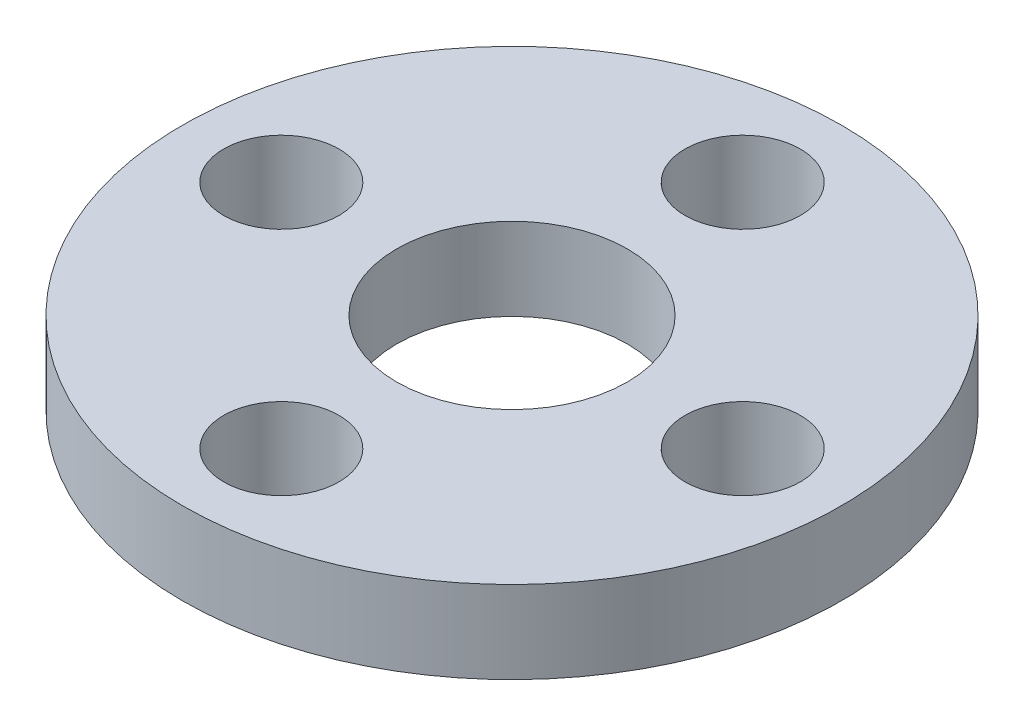
ISO-10303-21;
HEADER;
FILE_DESCRIPTION(('STEP AP214'),'2;1');
FILE_NAME('part.step','',(''),(''),'','','');
FILE_SCHEMA(('AUTOMOTIVE_DESIGN { 1 0 10303 214 1 1 1 1 }'));
ENDSEC;
DATA;
#1=APPLICATION_CONTEXT('core data for automotive mechanical design processes');
#2=APPLICATION_PROTOCOL_DEFINITION('international standard','automotive_design',2000,#1);
#3=PRODUCT_CONTEXT('',#1,'mechanical');
#4=PRODUCT('Part','Part','',(#3));
#5=PRODUCT_RELATED_PRODUCT_CATEGORY('part','',(#4));
#6=PRODUCT_DEFINITION_FORMATION('','',#4);
#7=PRODUCT_DEFINITION_CONTEXT('part definition',#1,'design');
#8=PRODUCT_DEFINITION('design','',#6,#7);
#9=PRODUCT_DEFINITION_SHAPE('','',#8);
#10=(LENGTH_UNIT() NAMED_UNIT(*) SI_UNIT(.MILLI.,.METRE.));
#11=(NAMED_UNIT(*) PLANE_ANGLE_UNIT() SI_UNIT($,.RADIAN.));
#12=(NAMED_UNIT(*) SI_UNIT($,.STERADIAN.) SOLID_ANGLE_UNIT());
#13=UNCERTAINTY_MEASURE_WITH_UNIT(LENGTH_MEASURE(1.E-05),#10,'distance_accuracy_value','');
#14=(GEOMETRIC_REPRESENTATION_CONTEXT(3) GLOBAL_UNCERTAINTY_ASSIGNED_CONTEXT((#13)) GLOBAL_UNIT_ASSIGNED_CONTEXT((#10,
#11,#12)) REPRESENTATION_CONTEXT('',''));
#15=CARTESIAN_POINT('',(0.,0.,0.));
#16=DIRECTION('',(0.,0.,1.));
#17=DIRECTION('',(1.,0.,0.));
#18=AXIS2_PLACEMENT_3D('',#15,#16,#17);
#19=CARTESIAN_POINT('',(0.,2.5,0.));
#20=DIRECTION('',(0.,1.,0.));
#21=DIRECTION('',(0.,0.,1.));
#22=AXIS2_PLACEMENT_3D('',#19,#20,#21);
#23=PLANE('',#22);
#24=CARTESIAN_POINT('',(0.,2.5,0.));
#25=DIRECTION('',(0.,1.,0.));
#26=DIRECTION('',(0.,0.,1.));
#27=AXIS2_PLACEMENT_3D('',#24,#25,#26);
#28=CIRCLE('',#27,3.5);
#29=CARTESIAN_POINT('',(0.,2.5,3.5));
#30=VERTEX_POINT('',#29);
#31=EDGE_CURVE('E75',#30,#30,#28,.T.);
#32=ORIENTED_EDGE('',*,*,#31,.F.);
#33=EDGE_LOOP('',(#32));
#34=FACE_BOUND('',#33,.T.);
#35=CARTESIAN_POINT('',(7.,2.5,0.));
#36=DIRECTION('',(0.,1.,0.));
#37=DIRECTION('',(0.,0.,1.));
#38=AXIS2_PLACEMENT_3D('',#35,#36,#37);
#39=CIRCLE('',#38,1.75);
#40=CARTESIAN_POINT('',(7.,2.5,1.75));
#41=VERTEX_POINT('',#40);
#42=EDGE_CURVE('E60',#41,#41,#39,.T.);
#43=ORIENTED_EDGE('',*,*,#42,.F.);
#44=EDGE_LOOP('',(#43));
#45=FACE_BOUND('',#44,.T.);
#46=CARTESIAN_POINT('',(-7.,2.5,0.));
#47=DIRECTION('',(0.,1.,0.));
#48=DIRECTION('',(0.,0.,1.));
#49=AXIS2_PLACEMENT_3D('',#46,#47,#48);
#50=CIRCLE('',#49,1.75);
#51=CARTESIAN_POINT('',(-7.,2.5,1.75));
#52=VERTEX_POINT('',#51);
#53=EDGE_CURVE('E49',#52,#52,#50,.T.);
#54=ORIENTED_EDGE('',*,*,#53,.F.);
#55=EDGE_LOOP('',(#54));
#56=FACE_BOUND('',#55,.T.);
#57=CARTESIAN_POINT('',(0.,2.5,0.));
#58=DIRECTION('',(0.,1.,0.));
#59=DIRECTION('',(0.,0.,1.));
#60=AXIS2_PLACEMENT_3D('',#57,#58,#59);
#61=CIRCLE('',#60,10.);
#62=CARTESIAN_POINT('',(0.,2.5,10.));
#63=VERTEX_POINT('',#62);
#64=EDGE_CURVE('E10',#63,#63,#61,.T.);
#65=ORIENTED_EDGE('',*,*,#64,.T.);
#66=EDGE_LOOP('',(#65));
#67=FACE_BOUND('',#66,.T.);
#68=CARTESIAN_POINT('',(0.,2.5,-7.));
#69=DIRECTION('',(0.,1.,0.));
#70=DIRECTION('',(0.,0.,1.));
#71=AXIS2_PLACEMENT_3D('',#68,#69,#70);
#72=CIRCLE('',#71,1.75);
#73=CARTESIAN_POINT('',(0.,2.5,-5.25));
#74=VERTEX_POINT('',#73);
#75=EDGE_CURVE('E54',#74,#74,#72,.T.);
#76=ORIENTED_EDGE('',*,*,#75,.F.);
#77=EDGE_LOOP('',(#76));
#78=FACE_BOUND('',#77,.T.);
#79=CARTESIAN_POINT('',(0.,2.5,7.));
#80=DIRECTION('',(0.,1.,0.));
#81=DIRECTION('',(0.,0.,1.));
#82=AXIS2_PLACEMENT_3D('',#79,#80,#81);
#83=CIRCLE('',#82,1.75);
#84=CARTESIAN_POINT('',(0.,2.5,8.75));
#85=VERTEX_POINT('',#84);
#86=EDGE_CURVE('E66',#85,#85,#83,.T.);
#87=ORIENTED_EDGE('',*,*,#86,.F.);
#88=EDGE_LOOP('',(#87));
#89=FACE_BOUND('',#88,.T.);
#90=ADVANCED_FACE('F38',(#34,#45,#56,#67,#78,#89),#23,.T.);
#91=CARTESIAN_POINT('',(0.,0.,0.));
#92=DIRECTION('',(0.,1.,0.));
#93=DIRECTION('',(0.,0.,1.));
#94=AXIS2_PLACEMENT_3D('',#91,#92,#93);
#95=PLANE('',#94);
#96=CARTESIAN_POINT('',(0.,0.,0.));
#97=DIRECTION('',(0.,1.,0.));
#98=DIRECTION('',(0.,0.,1.));
#99=AXIS2_PLACEMENT_3D('',#96,#97,#98);
#100=CIRCLE('',#99,3.5);
#101=CARTESIAN_POINT('',(0.,0.,3.5));
#102=VERTEX_POINT('',#101);
#103=EDGE_CURVE('E72',#102,#102,#100,.T.);
#104=ORIENTED_EDGE('',*,*,#103,.T.);
#105=EDGE_LOOP('',(#104));
#106=FACE_BOUND('',#105,.T.);
#107=CARTESIAN_POINT('',(0.,0.,0.));
#108=DIRECTION('',(0.,1.,0.));
#109=DIRECTION('',(0.,0.,1.));
#110=AXIS2_PLACEMENT_3D('',#107,#108,#109);
#111=CIRCLE('',#110,10.);
#112=CARTESIAN_POINT('',(0.,0.,10.));
#113=VERTEX_POINT('',#112);
#114=EDGE_CURVE('E42',#113,#113,#111,.T.);
#115=ORIENTED_EDGE('',*,*,#114,.F.);
#116=EDGE_LOOP('',(#115));
#117=FACE_BOUND('',#116,.T.);
#118=CARTESIAN_POINT('',(-7.,0.,0.));
#119=DIRECTION('',(0.,1.,0.));
#120=DIRECTION('',(0.,0.,1.));
#121=AXIS2_PLACEMENT_3D('',#118,#119,#120);
#122=CIRCLE('',#121,1.75);
#123=CARTESIAN_POINT('',(-7.,0.,1.75));
#124=VERTEX_POINT('',#123);
#125=EDGE_CURVE('E51',#124,#124,#122,.T.);
#126=ORIENTED_EDGE('',*,*,#125,.T.);
#127=EDGE_LOOP('',(#126));
#128=FACE_BOUND('',#127,.T.);
#129=CARTESIAN_POINT('',(0.,0.,-7.));
#130=DIRECTION('',(0.,1.,0.));
#131=DIRECTION('',(0.,0.,1.));
#132=AXIS2_PLACEMENT_3D('',#129,#130,#131);
#133=CIRCLE('',#132,1.75);
#134=CARTESIAN_POINT('',(0.,0.,-5.25));
#135=VERTEX_POINT('',#134);
#136=EDGE_CURVE('E57',#135,#135,#133,.T.);
#137=ORIENTED_EDGE('',*,*,#136,.T.);
#138=EDGE_LOOP('',(#137));
#139=FACE_BOUND('',#138,.T.);
#140=CARTESIAN_POINT('',(7.,0.,0.));
#141=DIRECTION('',(0.,1.,0.));
#142=DIRECTION('',(0.,0.,1.));
#143=AXIS2_PLACEMENT_3D('',#140,#141,#142);
#144=CIRCLE('',#143,1.75);
#145=CARTESIAN_POINT('',(7.,0.,1.75));
#146=VERTEX_POINT('',#145);
#147=EDGE_CURVE('E63',#146,#146,#144,.T.);
#148=ORIENTED_EDGE('',*,*,#147,.T.);
#149=EDGE_LOOP('',(#148));
#150=FACE_BOUND('',#149,.T.);
#151=CARTESIAN_POINT('',(0.,0.,7.));
#152=DIRECTION('',(0.,1.,0.));
#153=DIRECTION('',(0.,0.,1.));
#154=AXIS2_PLACEMENT_3D('',#151,#152,#153);
#155=CIRCLE('',#154,1.75);
#156=CARTESIAN_POINT('',(0.,0.,8.75));
#157=VERTEX_POINT('',#156);
#158=EDGE_CURVE('E69',#157,#157,#155,.T.);
#159=ORIENTED_EDGE('',*,*,#158,.T.);
#160=EDGE_LOOP('',(#159));
#161=FACE_BOUND('',#160,.T.);
#162=ADVANCED_FACE('F81',(#106,#117,#128,#139,#150,#161),#95,.F.);
#163=CARTESIAN_POINT('',(0.,2.5,0.));
#164=DIRECTION('',(0.,-1.,0.));
#165=DIRECTION('',(0.,0.,-1.));
#166=AXIS2_PLACEMENT_3D('',#163,#164,#165);
#167=CYLINDRICAL_SURFACE('',#166,10.);
#168=ORIENTED_EDGE('',*,*,#64,.F.);
#169=EDGE_LOOP('',(#168));
#170=FACE_BOUND('',#169,.T.);
#171=ORIENTED_EDGE('',*,*,#114,.T.);
#172=EDGE_LOOP('',(#171));
#173=FACE_BOUND('',#172,.T.);
#174=ADVANCED_FACE('F40',(#170,#173),#167,.T.);
#175=CARTESIAN_POINT('',(-7.,2.5,0.));
#176=DIRECTION('',(0.,-1.,0.));
#177=DIRECTION('',(0.,0.,-1.));
#178=AXIS2_PLACEMENT_3D('',#175,#176,#177);
#179=CYLINDRICAL_SURFACE('',#178,1.75);
#180=ORIENTED_EDGE('',*,*,#53,.T.);
#181=EDGE_LOOP('',(#180));
#182=FACE_BOUND('',#181,.T.);
#183=ORIENTED_EDGE('',*,*,#125,.F.);
#184=EDGE_LOOP('',(#183));
#185=FACE_BOUND('',#184,.T.);
#186=ADVANCED_FACE('F112',(#182,#185),#179,.F.);
#187=CARTESIAN_POINT('',(0.,2.5,-7.));
#188=DIRECTION('',(0.,-1.,0.));
#189=DIRECTION('',(0.,0.,-1.));
#190=AXIS2_PLACEMENT_3D('',#187,#188,#189);
#191=CYLINDRICAL_SURFACE('',#190,1.75);
#192=ORIENTED_EDGE('',*,*,#75,.T.);
#193=EDGE_LOOP('',(#192));
#194=FACE_BOUND('',#193,.T.);
#195=ORIENTED_EDGE('',*,*,#136,.F.);
#196=EDGE_LOOP('',(#195));
#197=FACE_BOUND('',#196,.T.);
#198=ADVANCED_FACE('F117',(#194,#197),#191,.F.);
#199=CARTESIAN_POINT('',(7.,2.5,0.));
#200=DIRECTION('',(0.,-1.,0.));
#201=DIRECTION('',(0.,0.,-1.));
#202=AXIS2_PLACEMENT_3D('',#199,#200,#201);
#203=CYLINDRICAL_SURFACE('',#202,1.75);
#204=ORIENTED_EDGE('',*,*,#42,.T.);
#205=EDGE_LOOP('',(#204));
#206=FACE_BOUND('',#205,.T.);
#207=ORIENTED_EDGE('',*,*,#147,.F.);
#208=EDGE_LOOP('',(#207));
#209=FACE_BOUND('',#208,.T.);
#210=ADVANCED_FACE('F104',(#206,#209),#203,.F.);
#211=CARTESIAN_POINT('',(0.,2.5,7.));
#212=DIRECTION('',(0.,-1.,0.));
#213=DIRECTION('',(0.,0.,-1.));
#214=AXIS2_PLACEMENT_3D('',#211,#212,#213);
#215=CYLINDRICAL_SURFACE('',#214,1.75);
#216=ORIENTED_EDGE('',*,*,#86,.T.);
#217=EDGE_LOOP('',(#216));
#218=FACE_BOUND('',#217,.T.);
#219=ORIENTED_EDGE('',*,*,#158,.F.);
#220=EDGE_LOOP('',(#219));
#221=FACE_BOUND('',#220,.T.);
#222=ADVANCED_FACE('F87',(#218,#221),#215,.F.);
#223=CARTESIAN_POINT('',(0.,0.,0.));
#224=DIRECTION('',(0.,1.,0.));
#225=DIRECTION('',(0.,0.,1.));
#226=AXIS2_PLACEMENT_3D('',#223,#224,#225);
#227=CYLINDRICAL_SURFACE('',#226,3.5);
#228=ORIENTED_EDGE('',*,*,#103,.F.);
#229=EDGE_LOOP('',(#228));
#230=FACE_BOUND('',#229,.T.);
#231=ORIENTED_EDGE('',*,*,#31,.T.);
#232=EDGE_LOOP('',(#231));
#233=FACE_BOUND('',#232,.T.);
#234=ADVANCED_FACE('F84',(#230,#233),#227,.F.);
#235=CLOSED_SHELL('',(#90,#162,#174,#186,#198,#210,#222,#234));
#236=MANIFOLD_SOLID_BREP('B2',#235);
#237=ADVANCED_BREP_SHAPE_REPRESENTATION('',(#18,#236),#14);
#238=SHAPE_DEFINITION_REPRESENTATION(#9,#237);
ENDSEC;
END-ISO-10303-21;
